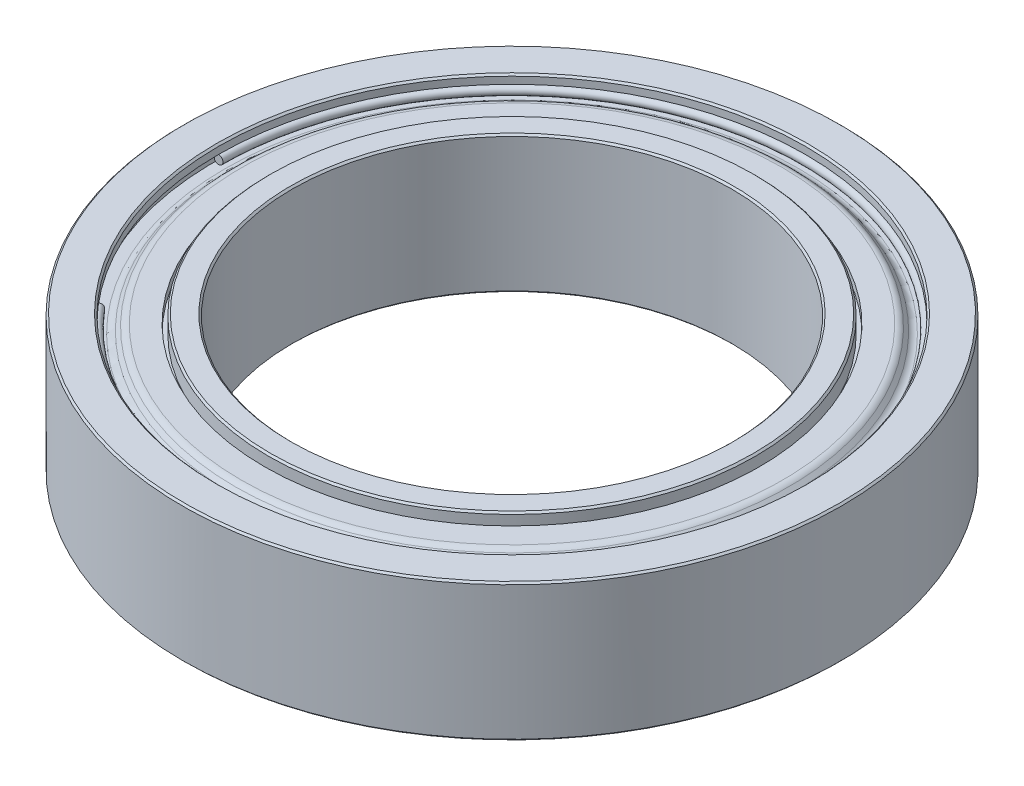
ISO-10303-21;
HEADER;
FILE_DESCRIPTION(('STEP AP214'),'2;1');
FILE_NAME('part.step','',(''),(''),'','','');
FILE_SCHEMA(('AUTOMOTIVE_DESIGN { 1 0 10303 214 1 1 1 1 }'));
ENDSEC;
DATA;
#1=APPLICATION_CONTEXT('core data for automotive mechanical design processes');
#2=APPLICATION_PROTOCOL_DEFINITION('international standard','automotive_design',2000,#1);
#3=PRODUCT_CONTEXT('',#1,'mechanical');
#4=PRODUCT('Part','Part','',(#3));
#5=PRODUCT_RELATED_PRODUCT_CATEGORY('part','',(#4));
#6=PRODUCT_DEFINITION_FORMATION('','',#4);
#7=PRODUCT_DEFINITION_CONTEXT('part definition',#1,'design');
#8=PRODUCT_DEFINITION('design','',#6,#7);
#9=PRODUCT_DEFINITION_SHAPE('','',#8);
#10=(LENGTH_UNIT() NAMED_UNIT(*) SI_UNIT(.MILLI.,.METRE.));
#11=(NAMED_UNIT(*) PLANE_ANGLE_UNIT() SI_UNIT($,.RADIAN.));
#12=(NAMED_UNIT(*) SI_UNIT($,.STERADIAN.) SOLID_ANGLE_UNIT());
#13=UNCERTAINTY_MEASURE_WITH_UNIT(LENGTH_MEASURE(1.E-05),#10,'distance_accuracy_value','');
#14=(GEOMETRIC_REPRESENTATION_CONTEXT(3) GLOBAL_UNCERTAINTY_ASSIGNED_CONTEXT((#13)) GLOBAL_UNIT_ASSIGNED_CONTEXT((#10,
#11,#12)) REPRESENTATION_CONTEXT('',''));
#15=CARTESIAN_POINT('',(0.,0.,0.));
#16=DIRECTION('',(0.,0.,1.));
#17=DIRECTION('',(1.,0.,0.));
#18=AXIS2_PLACEMENT_3D('',#15,#16,#17);
#19=CARTESIAN_POINT('',(0.,0.,0.));
#20=DIRECTION('',(0.64278760968653,0.,0.766044443118986));
#21=DIRECTION('',(0.766044443118986,0.,-0.64278760968653));
#22=AXIS2_PLACEMENT_3D('',#19,#20,#21);
#23=PLANE('',#22);
#24=CARTESIAN_POINT('',(-6.40152699336811,1.603375,5.37151893910646));
#25=CARTESIAN_POINT('',(-6.40153388771215,1.61760535707391,5.371524724148));
#26=CARTESIAN_POINT('',(-6.40339192267636,1.63192328029162,5.37308380060118));
#27=CARTESIAN_POINT('',(-6.41063050795078,1.65890213981076,5.37915769483519));
#28=CARTESIAN_POINT('',(-6.41601105826098,1.67156307611218,5.38367251261602));
#29=CARTESIAN_POINT('',(-6.42968009519439,1.6938588982527,5.39514219646539));
#30=CARTESIAN_POINT('',(-6.43796858181767,1.70349378409172,5.402097062534));
#31=CARTESIAN_POINT('',(-6.45652116513681,1.71863568307499,5.41766452835447));
#32=CARTESIAN_POINT('',(-6.46678526183267,1.72414269621925,5.42627712810634));
#33=CARTESIAN_POINT('',(-6.48813127804908,1.73041186264336,5.44418856244063));
#34=CARTESIAN_POINT('',(-6.49921319756962,1.73117401592321,5.45348739702306));
#35=CARTESIAN_POINT('',(-6.52094567214797,1.72786755040931,5.47172310842632));
#36=CARTESIAN_POINT('',(-6.53159622720577,1.72379893161555,5.48065998524715));
#37=CARTESIAN_POINT('',(-6.55126493147987,1.71128568190603,5.49716398774927));
#38=CARTESIAN_POINT('',(-6.56028308069616,1.70284105099026,5.50473111343057));
#39=CARTESIAN_POINT('',(-6.57567111865305,1.68254361413728,5.51764321040474));
#40=CARTESIAN_POINT('',(-6.58204100739366,1.67069080820007,5.52298818169762));
#41=CARTESIAN_POINT('',(-6.59141114673088,1.6448542051199,5.53085066215957));
#42=CARTESIAN_POINT('',(-6.59441139732751,1.63087040797693,5.53336817132864));
#43=CARTESIAN_POINT('',(-6.59592481258624,1.61228530553463,5.53463807751406));
#44=CARTESIAN_POINT('',(-6.59610444244233,1.60783445246292,5.53478880486005));
#45=CARTESIAN_POINT('',(-6.5960953875763,1.58914464292609,5.5347812069253));
#46=CARTESIAN_POINT('',(-6.59423735261209,1.57482671970838,5.53322213047212));
#47=CARTESIAN_POINT('',(-6.58699876733767,1.54784786018924,5.52714823623811));
#48=CARTESIAN_POINT('',(-6.58161821702747,1.53518692388782,5.52263341845729));
#49=CARTESIAN_POINT('',(-6.56794918009406,1.5128911017473,5.51116373460791));
#50=CARTESIAN_POINT('',(-6.55966069347078,1.50325621590828,5.50420886853931));
#51=CARTESIAN_POINT('',(-6.54110811015164,1.488114316925,5.48864140271883));
#52=CARTESIAN_POINT('',(-6.53084401345578,1.48260730378075,5.48002880296696));
#53=CARTESIAN_POINT('',(-6.50949799723937,1.47633813735664,5.46211736863267));
#54=CARTESIAN_POINT('',(-6.49841607771882,1.47557598407679,5.45281853405025));
#55=CARTESIAN_POINT('',(-6.47668360314048,1.47888244959069,5.43458282264699));
#56=CARTESIAN_POINT('',(-6.46603304808268,1.48295106838444,5.42564594582615));
#57=CARTESIAN_POINT('',(-6.44636434380859,1.49546431809397,5.40914194332403));
#58=CARTESIAN_POINT('',(-6.43734619459229,1.50390894900974,5.40157481764273));
#59=CARTESIAN_POINT('',(-6.4219581566354,1.52420638586272,5.38866272066856));
#60=CARTESIAN_POINT('',(-6.4155882678948,1.53605919179993,5.38331774937568));
#61=CARTESIAN_POINT('',(-6.40621812855757,1.5618957948801,5.37545526891373));
#62=CARTESIAN_POINT('',(-6.40321787796094,1.57587959202306,5.37293775974467));
#63=CARTESIAN_POINT('',(-6.40170446270221,1.59446469446536,5.37166785355925));
#64=CARTESIAN_POINT('',(-6.40152483284612,1.59891554753707,5.37151712621325));
#65=CARTESIAN_POINT('',(-6.40152699336811,1.603375,5.37151893910646));
#66=B_SPLINE_CURVE_WITH_KNOTS('',3,(#24,#25,#26,#27,#28,#29,#30,#31,#32,#33,#34,#35,#36,#37,#38,
#39,#40,#41,#42,#43,#44,#45,#46,#47,#48,#49,#50,#51,#52,#53,#54,#55,#56,#57,#58,#59,#60,#61,#62,
#63,#64,#65),.UNSPECIFIED.,.T.,.F.,(4,2,2,2,2,2,2,2,2,2,2,2,2,2,2,2,2,2,2,2,4),(0.,
0.0426429642402327,0.0852859284804661,0.127928892721774,0.170571856963084,0.213214821204392,
0.255857785445702,0.298500749687011,0.34114371392832,0.38378667816963,0.39714995998469,
0.439792924224922,0.482435888465155,0.525078852706464,0.567721816947774,0.610364781189083,
0.653007745430391,0.695650709671699,0.738293673913009,0.780936638154319,0.794299919969378),.UNSPECIFIED.);
#67=CARTESIAN_POINT('',(-6.40152699336811,1.603375,5.37151893910646));
#68=VERTEX_POINT('',#67);
#69=EDGE_CURVE('P0_E18',#68,#68,#66,.T.);
#70=ORIENTED_EDGE('',*,*,#69,.F.);
#71=EDGE_LOOP('',(#70));
#72=FACE_BOUND('',#71,.T.);
#73=ADVANCED_FACE('P0_F14',(#72),#23,.F.);
#74=CARTESIAN_POINT('',(0.,0.,0.));
#75=DIRECTION('',(0.,0.,1.));
#76=DIRECTION('',(1.,0.,0.));
#77=AXIS2_PLACEMENT_3D('',#74,#75,#76);
#78=PLANE('',#77);
#79=CARTESIAN_POINT('',(-8.6106,1.603375,0.));
#80=CARTESIAN_POINT('',(-8.61059100007304,1.61760535707391,0.));
#81=CARTESIAN_POINT('',(-8.60816550768693,1.63192328029162,0.));
#82=CARTESIAN_POINT('',(-8.59871620570525,1.65890213981076,0.));
#83=CARTESIAN_POINT('',(-8.59169239610969,1.67156307611218,0.));
#84=CARTESIAN_POINT('',(-8.57384873565866,1.6938588982527,0.));
#85=CARTESIAN_POINT('',(-8.56302888480311,1.70349378409172,0.));
#86=CARTESIAN_POINT('',(-8.53881020730236,1.71863568307499,0.));
#87=CARTESIAN_POINT('',(-8.52541138065716,1.72414269621925,0.));
#88=CARTESIAN_POINT('',(-8.49754613549006,1.73041186264336,0.));
#89=CARTESIAN_POINT('',(-8.48307971696815,1.73117401592321,0.));
#90=CARTESIAN_POINT('',(-8.45470998623835,1.72786755040931,0.));
#91=CARTESIAN_POINT('',(-8.44080667403046,1.72379893161555,0.));
#92=CARTESIAN_POINT('',(-8.41513100409934,1.71128568190603,0.));
#93=CARTESIAN_POINT('',(-8.4033586463761,1.70284105099026,0.));
#94=CARTESIAN_POINT('',(-8.38327098945865,1.68254361413728,0.));
#95=CARTESIAN_POINT('',(-8.37495569026443,1.67069080820007,0.));
#96=CARTESIAN_POINT('',(-8.36272384207156,1.6448542051199,0.));
#97=CARTESIAN_POINT('',(-8.3588072930729,1.63087040797693,0.));
#98=CARTESIAN_POINT('',(-8.35683166976236,1.61228530553463,0.));
#99=CARTESIAN_POINT('',(-8.35659717963884,1.60783445246292,0.));
#100=CARTESIAN_POINT('',(-8.35660899992696,1.58914464292609,0.));
#101=CARTESIAN_POINT('',(-8.35903449231307,1.57482671970838,0.));
#102=CARTESIAN_POINT('',(-8.36848379429475,1.54784786018924,0.));
#103=CARTESIAN_POINT('',(-8.37550760389031,1.53518692388782,0.));
#104=CARTESIAN_POINT('',(-8.39335126434134,1.5128911017473,0.));
#105=CARTESIAN_POINT('',(-8.4041711151969,1.50325621590828,0.));
#106=CARTESIAN_POINT('',(-8.42838979269765,1.488114316925,0.));
#107=CARTESIAN_POINT('',(-8.44178861934284,1.48260730378075,0.));
#108=CARTESIAN_POINT('',(-8.46965386450994,1.47633813735664,0.));
#109=CARTESIAN_POINT('',(-8.48412028303185,1.47557598407679,0.));
#110=CARTESIAN_POINT('',(-8.51249001376165,1.47888244959069,0.));
#111=CARTESIAN_POINT('',(-8.52639332596954,1.48295106838444,0.));
#112=CARTESIAN_POINT('',(-8.55206899590067,1.49546431809397,0.));
#113=CARTESIAN_POINT('',(-8.5638413536239,1.50390894900974,0.));
#114=CARTESIAN_POINT('',(-8.58392901054135,1.52420638586272,0.));
#115=CARTESIAN_POINT('',(-8.59224430973557,1.53605919179993,0.));
#116=CARTESIAN_POINT('',(-8.60447615792845,1.5618957948801,0.));
#117=CARTESIAN_POINT('',(-8.60839270692711,1.57587959202306,0.));
#118=CARTESIAN_POINT('',(-8.61036833023764,1.59446469446536,0.));
#119=CARTESIAN_POINT('',(-8.61060282036116,1.59891554753707,0.));
#120=CARTESIAN_POINT('',(-8.6106,1.603375,0.));
#121=B_SPLINE_CURVE_WITH_KNOTS('',3,(#79,#80,#81,#82,#83,#84,#85,#86,#87,#88,#89,#90,#91,#92,
#93,#94,#95,#96,#97,#98,#99,#100,#101,#102,#103,#104,#105,#106,#107,#108,#109,#110,#111,#112,
#113,#114,#115,#116,#117,#118,#119,#120),.UNSPECIFIED.,.T.,.F.,(4,2,2,2,2,2,2,2,2,2,2,2,2,2,2,2,
2,2,2,2,4),(0.,0.0426429642402329,0.085285928480466,0.127928892721774,0.170571856963085,
0.213214821204393,0.255857785445701,0.298500749687011,0.341143713928321,0.38378667816963,
0.397149959984689,0.439792924224922,0.482435888465155,0.525078852706464,0.567721816947774,
0.610364781189082,0.653007745430391,0.6956507096717,0.738293673913011,0.780936638154319,
0.794299919969379),.UNSPECIFIED.);
#122=CARTESIAN_POINT('',(-8.6106,1.603375,0.));
#123=VERTEX_POINT('',#122);
#124=EDGE_CURVE('P0_E10',#123,#123,#121,.T.);
#125=ORIENTED_EDGE('',*,*,#124,.F.);
#126=EDGE_LOOP('',(#125));
#127=FACE_BOUND('',#126,.T.);
#128=ADVANCED_FACE('P0_F34',(#127),#78,.T.);
#129=CARTESIAN_POINT('',(0.,1.603375,0.));
#130=DIRECTION('',(0.,1.,0.));
#131=DIRECTION('',(0.,0.,1.));
#132=AXIS2_PLACEMENT_3D('',#129,#130,#131);
#133=TOROIDAL_SURFACE('',#132,8.4836,0.127);
#134=ORIENTED_EDGE('',*,*,#124,.T.);
#135=EDGE_LOOP('',(#134));
#136=FACE_BOUND('',#135,.T.);
#137=ORIENTED_EDGE('',*,*,#69,.T.);
#138=EDGE_LOOP('',(#137));
#139=FACE_BOUND('',#138,.T.);
#140=ADVANCED_FACE('P0_F32',(#136,#139),#133,.T.);
#141=CLOSED_SHELL('',(#73,#128,#140));
#142=MANIFOLD_SOLID_BREP('P0_B1',#141);
#143=CARTESIAN_POINT('',(0.,0.,0.));
#144=DIRECTION('',(0.,0.,1.));
#145=DIRECTION('',(1.,0.,0.));
#146=AXIS2_PLACEMENT_3D('',#143,#144,#145);
#147=PLANE('',#146);
#148=CARTESIAN_POINT('',(-8.3566,-1.603375,0.));
#149=CARTESIAN_POINT('',(-8.35660899992696,-1.61760535707391,0.));
#150=CARTESIAN_POINT('',(-8.35903449231307,-1.63192328029162,0.));
#151=CARTESIAN_POINT('',(-8.36848379429475,-1.65890213981076,0.));
#152=CARTESIAN_POINT('',(-8.37550760389031,-1.67156307611218,0.));
#153=CARTESIAN_POINT('',(-8.39335126434134,-1.6938588982527,0.));
#154=CARTESIAN_POINT('',(-8.4041711151969,-1.70349378409172,0.));
#155=CARTESIAN_POINT('',(-8.42838979269765,-1.71863568307499,0.));
#156=CARTESIAN_POINT('',(-8.44178861934284,-1.72414269621925,0.));
#157=CARTESIAN_POINT('',(-8.46965386450994,-1.73041186264336,0.));
#158=CARTESIAN_POINT('',(-8.48412028303185,-1.73117401592321,0.));
#159=CARTESIAN_POINT('',(-8.51249001376165,-1.72786755040931,0.));
#160=CARTESIAN_POINT('',(-8.52639332596954,-1.72379893161555,0.));
#161=CARTESIAN_POINT('',(-8.55206899590067,-1.71128568190603,0.));
#162=CARTESIAN_POINT('',(-8.5638413536239,-1.70284105099026,0.));
#163=CARTESIAN_POINT('',(-8.58392901054135,-1.68254361413728,0.));
#164=CARTESIAN_POINT('',(-8.59224430973557,-1.67069080820007,0.));
#165=CARTESIAN_POINT('',(-8.60447615792845,-1.6448542051199,0.));
#166=CARTESIAN_POINT('',(-8.60839270692711,-1.63087040797693,0.));
#167=CARTESIAN_POINT('',(-8.61036833023764,-1.61228530553463,0.));
#168=CARTESIAN_POINT('',(-8.61060282036116,-1.60783445246292,0.));
#169=CARTESIAN_POINT('',(-8.61059100007304,-1.58914464292609,0.));
#170=CARTESIAN_POINT('',(-8.60816550768693,-1.57482671970838,0.));
#171=CARTESIAN_POINT('',(-8.59871620570525,-1.54784786018924,0.));
#172=CARTESIAN_POINT('',(-8.59169239610969,-1.53518692388782,0.));
#173=CARTESIAN_POINT('',(-8.57384873565866,-1.5128911017473,0.));
#174=CARTESIAN_POINT('',(-8.56302888480311,-1.50325621590828,0.));
#175=CARTESIAN_POINT('',(-8.53881020730236,-1.488114316925,0.));
#176=CARTESIAN_POINT('',(-8.52541138065716,-1.48260730378075,0.));
#177=CARTESIAN_POINT('',(-8.49754613549006,-1.47633813735664,0.));
#178=CARTESIAN_POINT('',(-8.48307971696815,-1.47557598407679,0.));
#179=CARTESIAN_POINT('',(-8.45470998623835,-1.47888244959069,0.));
#180=CARTESIAN_POINT('',(-8.44080667403046,-1.48295106838444,0.));
#181=CARTESIAN_POINT('',(-8.41513100409934,-1.49546431809397,0.));
#182=CARTESIAN_POINT('',(-8.4033586463761,-1.50390894900974,0.));
#183=CARTESIAN_POINT('',(-8.38327098945865,-1.52420638586272,0.));
#184=CARTESIAN_POINT('',(-8.37495569026443,-1.53605919179993,0.));
#185=CARTESIAN_POINT('',(-8.36272384207156,-1.5618957948801,0.));
#186=CARTESIAN_POINT('',(-8.3588072930729,-1.57587959202306,0.));
#187=CARTESIAN_POINT('',(-8.35683166976236,-1.59446469446536,0.));
#188=CARTESIAN_POINT('',(-8.35659717963884,-1.59891554753707,0.));
#189=CARTESIAN_POINT('',(-8.3566,-1.603375,0.));
#190=B_SPLINE_CURVE_WITH_KNOTS('',3,(#148,#149,#150,#151,#152,#153,#154,#155,#156,#157,#158,
#159,#160,#161,#162,#163,#164,#165,#166,#167,#168,#169,#170,#171,#172,#173,#174,#175,#176,#177,
#178,#179,#180,#181,#182,#183,#184,#185,#186,#187,#188,#189),.UNSPECIFIED.,.T.,.F.,(4,2,2,2,2,2,
2,2,2,2,2,2,2,2,2,2,2,2,2,2,4),(0.,0.0426429642402327,0.0852859284804662,0.127928892721774,
0.170571856963085,0.213214821204393,0.255857785445701,0.298500749687011,0.341143713928322,
0.383786678169629,0.39714995998469,0.439792924224922,0.482435888465155,0.525078852706464,
0.567721816947774,0.610364781189082,0.653007745430391,0.6956507096717,0.73829367391301,
0.780936638154319,0.794299919969379),.UNSPECIFIED.);
#191=CARTESIAN_POINT('',(-8.3566,-1.603375,0.));
#192=VERTEX_POINT('',#191);
#193=EDGE_CURVE('P1_E18',#192,#192,#190,.T.);
#194=ORIENTED_EDGE('',*,*,#193,.F.);
#195=EDGE_LOOP('',(#194));
#196=FACE_BOUND('',#195,.T.);
#197=ADVANCED_FACE('P1_F14',(#196),#147,.T.);
#198=CARTESIAN_POINT('',(0.,0.,0.));
#199=DIRECTION('',(0.64278760968653,0.,0.766044443118986));
#200=DIRECTION('',(0.766044443118986,0.,-0.64278760968653));
#201=AXIS2_PLACEMENT_3D('',#198,#199,#200);
#202=PLANE('',#201);
#203=CARTESIAN_POINT('',(-6.59610228192034,-1.603375,5.53478699196684));
#204=CARTESIAN_POINT('',(-6.59609538757631,-1.61760535707391,5.5347812069253));
#205=CARTESIAN_POINT('',(-6.5942373526121,-1.63192328029162,5.53322213047211));
#206=CARTESIAN_POINT('',(-6.58699876733768,-1.65890213981076,5.52714823623811));
#207=CARTESIAN_POINT('',(-6.58161821702747,-1.67156307611218,5.52263341845729));
#208=CARTESIAN_POINT('',(-6.56794918009406,-1.6938588982527,5.51116373460791));
#209=CARTESIAN_POINT('',(-6.55966069347078,-1.70349378409172,5.5042088685393));
#210=CARTESIAN_POINT('',(-6.54110811015165,-1.71863568307499,5.48864140271883));
#211=CARTESIAN_POINT('',(-6.53084401345578,-1.72414269621925,5.48002880296696));
#212=CARTESIAN_POINT('',(-6.50949799723937,-1.73041186264336,5.46211736863267));
#213=CARTESIAN_POINT('',(-6.49841607771883,-1.73117401592321,5.45281853405024));
#214=CARTESIAN_POINT('',(-6.47668360314048,-1.72786755040931,5.43458282264698));
#215=CARTESIAN_POINT('',(-6.46603304808268,-1.72379893161555,5.42564594582615));
#216=CARTESIAN_POINT('',(-6.44636434380859,-1.71128568190603,5.40914194332402));
#217=CARTESIAN_POINT('',(-6.43734619459229,-1.70284105099026,5.40157481764273));
#218=CARTESIAN_POINT('',(-6.4219581566354,-1.68254361413728,5.38866272066856));
#219=CARTESIAN_POINT('',(-6.4155882678948,-1.67069080820007,5.38331774937568));
#220=CARTESIAN_POINT('',(-6.40621812855757,-1.6448542051199,5.37545526891373));
#221=CARTESIAN_POINT('',(-6.40321787796094,-1.63087040797693,5.37293775974466));
#222=CARTESIAN_POINT('',(-6.40170446270221,-1.61228530553463,5.37166785355924));
#223=CARTESIAN_POINT('',(-6.40152483284612,-1.60783445246292,5.37151712621325));
#224=CARTESIAN_POINT('',(-6.40153388771215,-1.58914464292609,5.37152472414799));
#225=CARTESIAN_POINT('',(-6.40339192267636,-1.57482671970838,5.37308380060118));
#226=CARTESIAN_POINT('',(-6.41063050795078,-1.54784786018924,5.37915769483519));
#227=CARTESIAN_POINT('',(-6.41601105826099,-1.53518692388782,5.38367251261601));
#228=CARTESIAN_POINT('',(-6.4296800951944,-1.5128911017473,5.39514219646539));
#229=CARTESIAN_POINT('',(-6.43796858181767,-1.50325621590828,5.40209706253399));
#230=CARTESIAN_POINT('',(-6.45652116513681,-1.488114316925,5.41766452835447));
#231=CARTESIAN_POINT('',(-6.46678526183267,-1.48260730378075,5.42627712810634));
#232=CARTESIAN_POINT('',(-6.48813127804908,-1.47633813735664,5.44418856244063));
#233=CARTESIAN_POINT('',(-6.49921319756963,-1.47557598407679,5.45348739702305));
#234=CARTESIAN_POINT('',(-6.52094567214798,-1.47888244959069,5.47172310842631));
#235=CARTESIAN_POINT('',(-6.53159622720578,-1.48295106838444,5.48065998524715));
#236=CARTESIAN_POINT('',(-6.55126493147987,-1.49546431809397,5.49716398774927));
#237=CARTESIAN_POINT('',(-6.56028308069616,-1.50390894900974,5.50473111343057));
#238=CARTESIAN_POINT('',(-6.57567111865306,-1.52420638586272,5.51764321040474));
#239=CARTESIAN_POINT('',(-6.58204100739366,-1.53605919179993,5.52298818169762));
#240=CARTESIAN_POINT('',(-6.59141114673089,-1.5618957948801,5.53085066215957));
#241=CARTESIAN_POINT('',(-6.59441139732751,-1.57587959202306,5.53336817132864));
#242=CARTESIAN_POINT('',(-6.59592481258624,-1.59446469446536,5.53463807751405));
#243=CARTESIAN_POINT('',(-6.59610444244234,-1.59891554753707,5.53478880486005));
#244=CARTESIAN_POINT('',(-6.59610228192034,-1.603375,5.53478699196684));
#245=B_SPLINE_CURVE_WITH_KNOTS('',3,(#203,#204,#205,#206,#207,#208,#209,#210,#211,#212,#213,
#214,#215,#216,#217,#218,#219,#220,#221,#222,#223,#224,#225,#226,#227,#228,#229,#230,#231,#232,
#233,#234,#235,#236,#237,#238,#239,#240,#241,#242,#243,#244),.UNSPECIFIED.,.T.,.F.,(4,2,2,2,2,2,
2,2,2,2,2,2,2,2,2,2,2,2,2,2,4),(0.,0.042642964240233,0.0852859284804657,0.127928892721774,
0.170571856963083,0.213214821204394,0.255857785445705,0.298500749687011,0.341143713928322,
0.38378667816963,0.397149959984689,0.439792924224922,0.482435888465155,0.525078852706463,
0.567721816947773,0.610364781189082,0.653007745430392,0.695650709671701,0.73829367391301,
0.780936638154319,0.794299919969378),.UNSPECIFIED.);
#246=CARTESIAN_POINT('',(-6.59610228192034,-1.603375,5.53478699196684));
#247=VERTEX_POINT('',#246);
#248=EDGE_CURVE('P1_E10',#247,#247,#245,.T.);
#249=ORIENTED_EDGE('',*,*,#248,.F.);
#250=EDGE_LOOP('',(#249));
#251=FACE_BOUND('',#250,.T.);
#252=ADVANCED_FACE('P1_F32',(#251),#202,.F.);
#253=CARTESIAN_POINT('',(0.,-1.603375,0.));
#254=DIRECTION('',(0.,-1.,0.));
#255=DIRECTION('',(0.,0.,1.));
#256=AXIS2_PLACEMENT_3D('',#253,#254,#255);
#257=TOROIDAL_SURFACE('',#256,8.4836,0.127);
#258=ORIENTED_EDGE('',*,*,#248,.T.);
#259=EDGE_LOOP('',(#258));
#260=FACE_BOUND('',#259,.T.);
#261=ORIENTED_EDGE('',*,*,#193,.T.);
#262=EDGE_LOOP('',(#261));
#263=FACE_BOUND('',#262,.T.);
#264=ADVANCED_FACE('P1_F34',(#260,#263),#257,.T.);
#265=CLOSED_SHELL('',(#197,#252,#264));
#266=MANIFOLD_SOLID_BREP('P1_B1',#265);
#267=CARTESIAN_POINT('',(0.,1.984375,0.));
#268=DIRECTION('',(0.,-1.,0.));
#269=DIRECTION('',(0.,0.,-1.));
#270=AXIS2_PLACEMENT_3D('',#267,#268,#269);
#271=CYLINDRICAL_SURFACE('',#270,6.35);
#272=CARTESIAN_POINT('',(0.,-1.93357500000957,0.));
#273=DIRECTION('',(0.,-1.,0.));
#274=DIRECTION('',(0.,0.,-1.));
#275=AXIS2_PLACEMENT_3D('',#272,#273,#274);
#276=CIRCLE('',#275,6.34999999999764);
#277=CARTESIAN_POINT('',(0.,-1.93357500000957,-6.34999999999764));
#278=VERTEX_POINT('',#277);
#279=EDGE_CURVE('P2_E408',#278,#278,#276,.T.);
#280=ORIENTED_EDGE('',*,*,#279,.T.);
#281=EDGE_LOOP('',(#280));
#282=FACE_BOUND('',#281,.T.);
#283=CARTESIAN_POINT('',(0.,1.93357500000957,0.));
#284=DIRECTION('',(0.,1.,0.));
#285=DIRECTION('',(0.,0.,1.));
#286=AXIS2_PLACEMENT_3D('',#283,#284,#285);
#287=CIRCLE('',#286,6.34999999999764);
#288=CARTESIAN_POINT('',(0.,1.93357500000957,6.34999999999764));
#289=VERTEX_POINT('',#288);
#290=EDGE_CURVE('P2_E411',#289,#289,#287,.T.);
#291=ORIENTED_EDGE('',*,*,#290,.T.);
#292=EDGE_LOOP('',(#291));
#293=FACE_BOUND('',#292,.T.);
#294=ADVANCED_FACE('P2_F15',(#282,#293),#271,.F.);
#295=CARTESIAN_POINT('',(0.,1.98437500000637,0.));
#296=DIRECTION('',(0.,1.,0.));
#297=DIRECTION('',(0.,0.,1.));
#298=AXIS2_PLACEMENT_3D('',#295,#296,#297);
#299=CONICAL_SURFACE('',#298,6.40079999999443,0.785398163397448);
#300=ORIENTED_EDGE('',*,*,#290,.F.);
#301=EDGE_LOOP('',(#300));
#302=FACE_BOUND('',#301,.T.);
#303=CARTESIAN_POINT('',(0.,1.98437500000637,0.));
#304=DIRECTION('',(0.,1.,0.));
#305=DIRECTION('',(0.,0.,1.));
#306=AXIS2_PLACEMENT_3D('',#303,#304,#305);
#307=CIRCLE('',#306,6.40079999999443);
#308=CARTESIAN_POINT('',(0.,1.98437500000637,6.40079999999443));
#309=VERTEX_POINT('',#308);
#310=EDGE_CURVE('P2_E406',#309,#309,#307,.F.);
#311=ORIENTED_EDGE('',*,*,#310,.F.);
#312=EDGE_LOOP('',(#311));
#313=FACE_BOUND('',#312,.T.);
#314=ADVANCED_FACE('P2_F184',(#302,#313),#299,.F.);
#315=CARTESIAN_POINT('',(0.,-1.98437499994952,0.));
#316=DIRECTION('',(0.,-1.,0.));
#317=DIRECTION('',(0.,0.,-1.));
#318=AXIS2_PLACEMENT_3D('',#315,#316,#317);
#319=CONICAL_SURFACE('',#318,6.40079999993759,0.785398163397448);
#320=CARTESIAN_POINT('',(0.,-1.98437499994952,0.));
#321=DIRECTION('',(0.,-1.,0.));
#322=DIRECTION('',(0.,0.,-1.));
#323=AXIS2_PLACEMENT_3D('',#320,#321,#322);
#324=CIRCLE('',#323,6.40079999993759);
#325=CARTESIAN_POINT('',(0.,-1.98437499994952,-6.40079999993759));
#326=VERTEX_POINT('',#325);
#327=EDGE_CURVE('P2_E404',#326,#326,#324,.T.);
#328=ORIENTED_EDGE('',*,*,#327,.T.);
#329=EDGE_LOOP('',(#328));
#330=FACE_BOUND('',#329,.T.);
#331=ORIENTED_EDGE('',*,*,#279,.F.);
#332=EDGE_LOOP('',(#331));
#333=FACE_BOUND('',#332,.T.);
#334=ADVANCED_FACE('P2_F181',(#330,#333),#319,.F.);
#335=CARTESIAN_POINT('',(0.,1.984375,0.));
#336=DIRECTION('',(0.,1.,0.));
#337=DIRECTION('',(0.,0.,1.));
#338=AXIS2_PLACEMENT_3D('',#335,#336,#337);
#339=PLANE('',#338);
#340=ORIENTED_EDGE('',*,*,#310,.T.);
#341=EDGE_LOOP('',(#340));
#342=FACE_BOUND('',#341,.T.);
#343=CARTESIAN_POINT('',(0.,1.98437500000637,0.));
#344=DIRECTION('',(0.,-1.,0.));
#345=DIRECTION('',(0.,0.,-1.));
#346=AXIS2_PLACEMENT_3D('',#343,#344,#345);
#347=CIRCLE('',#346,6.98499999998603);
#348=CARTESIAN_POINT('',(0.,1.98437500000637,-6.98499999998603));
#349=VERTEX_POINT('',#348);
#350=EDGE_CURVE('P2_E401',#349,#349,#347,.T.);
#351=ORIENTED_EDGE('',*,*,#350,.F.);
#352=EDGE_LOOP('',(#351));
#353=FACE_BOUND('',#352,.T.);
#354=ADVANCED_FACE('P2_F177',(#342,#353),#339,.T.);
#355=CARTESIAN_POINT('',(0.,-1.984375,0.));
#356=DIRECTION('',(0.,1.,0.));
#357=DIRECTION('',(0.,0.,1.));
#358=AXIS2_PLACEMENT_3D('',#355,#356,#357);
#359=PLANE('',#358);
#360=CARTESIAN_POINT('',(0.,-1.984375,0.));
#361=DIRECTION('',(0.,1.,0.));
#362=DIRECTION('',(0.,0.,1.));
#363=AXIS2_PLACEMENT_3D('',#360,#361,#362);
#364=CIRCLE('',#363,6.985);
#365=CARTESIAN_POINT('',(0.,-1.984375,6.985));
#366=VERTEX_POINT('',#365);
#367=EDGE_CURVE('P2_E397',#366,#366,#364,.T.);
#368=ORIENTED_EDGE('',*,*,#367,.F.);
#369=EDGE_LOOP('',(#368));
#370=FACE_BOUND('',#369,.T.);
#371=ORIENTED_EDGE('',*,*,#327,.F.);
#372=EDGE_LOOP('',(#371));
#373=FACE_BOUND('',#372,.T.);
#374=ADVANCED_FACE('P2_F173',(#370,#373),#359,.F.);
#375=CARTESIAN_POINT('',(0.,1.93357500006641,0.));
#376=DIRECTION('',(0.,-1.,0.));
#377=DIRECTION('',(0.,0.,-1.));
#378=AXIS2_PLACEMENT_3D('',#375,#376,#377);
#379=CONICAL_SURFACE('',#378,7.03579999992598,0.785398163397448);
#380=ORIENTED_EDGE('',*,*,#350,.T.);
#381=EDGE_LOOP('',(#380));
#382=FACE_BOUND('',#381,.T.);
#383=CARTESIAN_POINT('',(0.,1.93357500000001,0.));
#384=DIRECTION('',(0.,1.,0.));
#385=DIRECTION('',(0.,0.,1.));
#386=AXIS2_PLACEMENT_3D('',#383,#384,#385);
#387=CIRCLE('',#386,7.0358);
#388=CARTESIAN_POINT('',(0.,1.93357500000001,7.0358));
#389=VERTEX_POINT('',#388);
#390=EDGE_CURVE('P2_E400',#389,#389,#387,.F.);
#391=ORIENTED_EDGE('',*,*,#390,.F.);
#392=EDGE_LOOP('',(#391));
#393=FACE_BOUND('',#392,.T.);
#394=ADVANCED_FACE('P2_F169',(#382,#393),#379,.T.);
#395=CARTESIAN_POINT('',(0.,-1.933575,0.));
#396=DIRECTION('',(0.,1.,0.));
#397=DIRECTION('',(0.,0.,1.));
#398=AXIS2_PLACEMENT_3D('',#395,#396,#397);
#399=CONICAL_SURFACE('',#398,7.0358,0.785398163397446);
#400=CARTESIAN_POINT('',(0.,-1.933575,0.));
#401=DIRECTION('',(0.,-1.,0.));
#402=DIRECTION('',(0.,0.,-1.));
#403=AXIS2_PLACEMENT_3D('',#400,#401,#402);
#404=CIRCLE('',#403,7.0358);
#405=CARTESIAN_POINT('',(0.,-1.933575,-7.0358));
#406=VERTEX_POINT('',#405);
#407=EDGE_CURVE('P2_E77',#406,#406,#404,.F.);
#408=ORIENTED_EDGE('',*,*,#407,.F.);
#409=EDGE_LOOP('',(#408));
#410=FACE_BOUND('',#409,.T.);
#411=ORIENTED_EDGE('',*,*,#367,.T.);
#412=EDGE_LOOP('',(#411));
#413=FACE_BOUND('',#412,.T.);
#414=ADVANCED_FACE('P2_F165',(#410,#413),#399,.T.);
#415=CARTESIAN_POINT('',(0.,1.730375,0.));
#416=DIRECTION('',(0.,1.,0.));
#417=DIRECTION('',(0.,0.,1.));
#418=AXIS2_PLACEMENT_3D('',#415,#416,#417);
#419=CYLINDRICAL_SURFACE('',#418,7.0358);
#420=CARTESIAN_POINT('',(0.,1.476375,0.));
#421=DIRECTION('',(0.,1.,0.));
#422=DIRECTION('',(0.,0.,1.));
#423=AXIS2_PLACEMENT_3D('',#420,#421,#422);
#424=CIRCLE('',#423,7.0358);
#425=CARTESIAN_POINT('',(0.,1.476375,7.0358));
#426=VERTEX_POINT('',#425);
#427=EDGE_CURVE('P2_E394',#426,#426,#424,.F.);
#428=ORIENTED_EDGE('',*,*,#427,.F.);
#429=EDGE_LOOP('',(#428));
#430=FACE_BOUND('',#429,.T.);
#431=ORIENTED_EDGE('',*,*,#390,.T.);
#432=EDGE_LOOP('',(#431));
#433=FACE_BOUND('',#432,.T.);
#434=ADVANCED_FACE('P2_F161',(#430,#433),#419,.T.);
#435=CARTESIAN_POINT('',(0.,-1.730375,0.));
#436=DIRECTION('',(0.,-1.,0.));
#437=DIRECTION('',(0.,0.,-1.));
#438=AXIS2_PLACEMENT_3D('',#435,#436,#437);
#439=CYLINDRICAL_SURFACE('',#438,7.0358);
#440=ORIENTED_EDGE('',*,*,#407,.T.);
#441=EDGE_LOOP('',(#440));
#442=FACE_BOUND('',#441,.T.);
#443=CARTESIAN_POINT('',(0.,-1.476375,0.));
#444=DIRECTION('',(0.,-1.,0.));
#445=DIRECTION('',(0.,0.,-1.));
#446=AXIS2_PLACEMENT_3D('',#443,#444,#445);
#447=CIRCLE('',#446,7.0358);
#448=CARTESIAN_POINT('',(0.,-1.476375,-7.0358));
#449=VERTEX_POINT('',#448);
#450=EDGE_CURVE('P2_E391',#449,#449,#447,.F.);
#451=ORIENTED_EDGE('',*,*,#450,.F.);
#452=EDGE_LOOP('',(#451));
#453=FACE_BOUND('',#452,.T.);
#454=ADVANCED_FACE('P2_F157',(#442,#453),#439,.T.);
#455=CARTESIAN_POINT('',(0.,1.476375,0.));
#456=DIRECTION('',(0.,1.,0.));
#457=DIRECTION('',(0.,0.,1.));
#458=AXIS2_PLACEMENT_3D('',#455,#456,#457);
#459=PLANE('',#458);
#460=CARTESIAN_POINT('',(0.,1.476375,0.));
#461=DIRECTION('',(0.,1.,0.));
#462=DIRECTION('',(0.,0.,1.));
#463=AXIS2_PLACEMENT_3D('',#460,#461,#462);
#464=CIRCLE('',#463,7.15329558420875);
#465=CARTESIAN_POINT('',(0.,1.476375,7.15329558420875));
#466=VERTEX_POINT('',#465);
#467=EDGE_CURVE('P2_E388',#466,#466,#464,.T.);
#468=ORIENTED_EDGE('',*,*,#467,.T.);
#469=EDGE_LOOP('',(#468));
#470=FACE_BOUND('',#469,.T.);
#471=ORIENTED_EDGE('',*,*,#427,.T.);
#472=EDGE_LOOP('',(#471));
#473=FACE_BOUND('',#472,.T.);
#474=ADVANCED_FACE('P2_F153',(#470,#473),#459,.T.);
#475=CARTESIAN_POINT('',(0.,-1.476375,0.));
#476=DIRECTION('',(0.,-1.,0.));
#477=DIRECTION('',(0.,0.,-1.));
#478=AXIS2_PLACEMENT_3D('',#475,#476,#477);
#479=PLANE('',#478);
#480=ORIENTED_EDGE('',*,*,#450,.T.);
#481=EDGE_LOOP('',(#480));
#482=FACE_BOUND('',#481,.T.);
#483=CARTESIAN_POINT('',(0.,-1.476375,0.));
#484=DIRECTION('',(0.,-1.,0.));
#485=DIRECTION('',(0.,0.,-1.));
#486=AXIS2_PLACEMENT_3D('',#483,#484,#485);
#487=CIRCLE('',#486,7.15329558420875);
#488=CARTESIAN_POINT('',(0.,-1.476375,-7.15329558420875));
#489=VERTEX_POINT('',#488);
#490=EDGE_CURVE('P2_E385',#489,#489,#487,.T.);
#491=ORIENTED_EDGE('',*,*,#490,.T.);
#492=EDGE_LOOP('',(#491));
#493=FACE_BOUND('',#492,.T.);
#494=ADVANCED_FACE('P2_F149',(#482,#493),#479,.T.);
#495=CARTESIAN_POINT('',(0.,1.476375,0.));
#496=DIRECTION('',(0.,1.,0.));
#497=DIRECTION('',(0.,0.,1.));
#498=AXIS2_PLACEMENT_3D('',#495,#496,#497);
#499=CYLINDRICAL_SURFACE('',#498,7.15329558420875);
#500=CARTESIAN_POINT('',(0.,1.730375,0.));
#501=DIRECTION('',(0.,1.,0.));
#502=DIRECTION('',(0.,0.,1.));
#503=AXIS2_PLACEMENT_3D('',#500,#501,#502);
#504=CIRCLE('',#503,7.15329558420875);
#505=CARTESIAN_POINT('',(0.,1.730375,7.15329558420875));
#506=VERTEX_POINT('',#505);
#507=EDGE_CURVE('P2_E382',#506,#506,#504,.F.);
#508=ORIENTED_EDGE('',*,*,#507,.F.);
#509=EDGE_LOOP('',(#508));
#510=FACE_BOUND('',#509,.T.);
#511=ORIENTED_EDGE('',*,*,#467,.F.);
#512=EDGE_LOOP('',(#511));
#513=FACE_BOUND('',#512,.T.);
#514=ADVANCED_FACE('P2_F145',(#510,#513),#499,.F.);
#515=CARTESIAN_POINT('',(0.,-1.476375,0.));
#516=DIRECTION('',(0.,-1.,0.));
#517=DIRECTION('',(0.,0.,-1.));
#518=AXIS2_PLACEMENT_3D('',#515,#516,#517);
#519=CYLINDRICAL_SURFACE('',#518,7.15329558420875);
#520=ORIENTED_EDGE('',*,*,#490,.F.);
#521=EDGE_LOOP('',(#520));
#522=FACE_BOUND('',#521,.T.);
#523=CARTESIAN_POINT('',(0.,-1.730375,0.));
#524=DIRECTION('',(0.,-1.,0.));
#525=DIRECTION('',(0.,0.,-1.));
#526=AXIS2_PLACEMENT_3D('',#523,#524,#525);
#527=CIRCLE('',#526,7.15329558420875);
#528=CARTESIAN_POINT('',(0.,-1.730375,-7.15329558420875));
#529=VERTEX_POINT('',#528);
#530=EDGE_CURVE('P2_E63',#529,#529,#527,.F.);
#531=ORIENTED_EDGE('',*,*,#530,.F.);
#532=EDGE_LOOP('',(#531));
#533=FACE_BOUND('',#532,.T.);
#534=ADVANCED_FACE('P2_F141',(#522,#533),#519,.F.);
#535=CARTESIAN_POINT('',(0.,1.730375,0.));
#536=DIRECTION('',(0.,1.,0.));
#537=DIRECTION('',(0.,0.,1.));
#538=AXIS2_PLACEMENT_3D('',#535,#536,#537);
#539=PLANE('',#538);
#540=CARTESIAN_POINT('',(0.,1.730375,0.));
#541=DIRECTION('',(0.,-1.,0.));
#542=DIRECTION('',(0.,0.,-1.));
#543=AXIS2_PLACEMENT_3D('',#540,#541,#542);
#544=CIRCLE('',#543,7.82302198243957);
#545=CARTESIAN_POINT('',(0.,1.730375,-7.82302198243957));
#546=VERTEX_POINT('',#545);
#547=CARTESIAN_POINT('',(0.,1.730375,7.82302198243957));
#548=VERTEX_POINT('',#547);
#549=EDGE_CURVE('P2_E61',#546,#548,#544,.T.);
#550=ORIENTED_EDGE('',*,*,#549,.F.);
#551=CARTESIAN_POINT('',(0.,1.730375,0.));
#552=DIRECTION('',(0.,-1.,0.));
#553=DIRECTION('',(0.,0.,1.));
#554=AXIS2_PLACEMENT_3D('',#551,#552,#553);
#555=CIRCLE('',#554,7.82302198243957);
#556=EDGE_CURVE('P2_E55',#548,#546,#555,.T.);
#557=ORIENTED_EDGE('',*,*,#556,.F.);
#558=EDGE_LOOP('',(#550,#557));
#559=FACE_BOUND('',#558,.T.);
#560=ORIENTED_EDGE('',*,*,#507,.T.);
#561=EDGE_LOOP('',(#560));
#562=FACE_BOUND('',#561,.T.);
#563=ADVANCED_FACE('P2_F59',(#559,#562),#539,.T.);
#564=CARTESIAN_POINT('',(0.,-1.730375,0.));
#565=DIRECTION('',(0.,-1.,0.));
#566=DIRECTION('',(0.,0.,-1.));
#567=AXIS2_PLACEMENT_3D('',#564,#565,#566);
#568=PLANE('',#567);
#569=ORIENTED_EDGE('',*,*,#530,.T.);
#570=EDGE_LOOP('',(#569));
#571=FACE_BOUND('',#570,.T.);
#572=CARTESIAN_POINT('',(0.,-1.730375,0.));
#573=DIRECTION('',(0.,1.,0.));
#574=DIRECTION('',(0.,0.,1.));
#575=AXIS2_PLACEMENT_3D('',#572,#573,#574);
#576=CIRCLE('',#575,7.82302198243956);
#577=CARTESIAN_POINT('',(0.,-1.730375,7.82302198243956));
#578=VERTEX_POINT('',#577);
#579=CARTESIAN_POINT('',(0.,-1.730375,-7.82302198243956));
#580=VERTEX_POINT('',#579);
#581=EDGE_CURVE('P2_E104',#578,#580,#576,.T.);
#582=ORIENTED_EDGE('',*,*,#581,.F.);
#583=CARTESIAN_POINT('',(0.,-1.730375,0.));
#584=DIRECTION('',(0.,1.,0.));
#585=DIRECTION('',(0.,0.,-1.));
#586=AXIS2_PLACEMENT_3D('',#583,#584,#585);
#587=CIRCLE('',#586,7.82302198243956);
#588=EDGE_CURVE('P2_E69',#580,#578,#587,.T.);
#589=ORIENTED_EDGE('',*,*,#588,.F.);
#590=EDGE_LOOP('',(#582,#589));
#591=FACE_BOUND('',#590,.T.);
#592=ADVANCED_FACE('P2_F90',(#571,#591),#568,.T.);
#593=CARTESIAN_POINT('',(0.,1.476375,0.));
#594=DIRECTION('',(0.,1.,0.));
#595=DIRECTION('',(0.,0.,1.));
#596=AXIS2_PLACEMENT_3D('',#593,#594,#595);
#597=TOROIDAL_SURFACE('',#596,7.82302198243957,0.254);
#598=ORIENTED_EDGE('',*,*,#556,.T.);
#599=ORIENTED_EDGE('',*,*,#549,.T.);
#600=EDGE_LOOP('',(#598,#599));
#601=FACE_BOUND('',#600,.T.);
#602=CARTESIAN_POINT('',(0.,1.65598012242138,0.));
#603=DIRECTION('',(0.,-1.,0.));
#604=DIRECTION('',(0.,0.,-1.));
#605=AXIS2_PLACEMENT_3D('',#602,#603,#604);
#606=CIRCLE('',#605,8.00262710486095);
#607=CARTESIAN_POINT('',(0.,1.65598012242138,-8.00262710486095));
#608=VERTEX_POINT('',#607);
#609=EDGE_CURVE('P2_E99',#608,#608,#606,.T.);
#610=ORIENTED_EDGE('',*,*,#609,.F.);
#611=EDGE_LOOP('',(#610));
#612=FACE_BOUND('',#611,.T.);
#613=ADVANCED_FACE('P2_F67',(#601,#612),#597,.T.);
#614=CARTESIAN_POINT('',(0.,-1.476375,0.));
#615=DIRECTION('',(0.,-1.,0.));
#616=DIRECTION('',(0.,0.,-1.));
#617=AXIS2_PLACEMENT_3D('',#614,#615,#616);
#618=TOROIDAL_SURFACE('',#617,7.82302198243956,0.254);
#619=ORIENTED_EDGE('',*,*,#588,.T.);
#620=ORIENTED_EDGE('',*,*,#581,.T.);
#621=EDGE_LOOP('',(#619,#620));
#622=FACE_BOUND('',#621,.T.);
#623=CARTESIAN_POINT('',(0.,-1.65598012242138,0.));
#624=DIRECTION('',(0.,1.,0.));
#625=DIRECTION('',(0.,0.,1.));
#626=AXIS2_PLACEMENT_3D('',#623,#624,#625);
#627=CIRCLE('',#626,8.00262710486095);
#628=CARTESIAN_POINT('',(0.,-1.65598012242138,8.00262710486095));
#629=VERTEX_POINT('',#628);
#630=EDGE_CURVE('P2_E343',#629,#629,#627,.T.);
#631=ORIENTED_EDGE('',*,*,#630,.F.);
#632=EDGE_LOOP('',(#631));
#633=FACE_BOUND('',#632,.T.);
#634=ADVANCED_FACE('P2_F89',(#622,#633),#618,.T.);
#635=CARTESIAN_POINT('',(0.,1.55076987757862,0.));
#636=DIRECTION('',(0.,-1.,0.));
#637=DIRECTION('',(0.,0.,-1.));
#638=AXIS2_PLACEMENT_3D('',#635,#636,#637);
#639=CONICAL_SURFACE('',#638,8.10783734970371,0.785398163397444);
#640=CARTESIAN_POINT('',(0.,1.55076987757862,0.));
#641=DIRECTION('',(0.,1.,0.));
#642=DIRECTION('',(0.,0.,1.));
#643=AXIS2_PLACEMENT_3D('',#640,#641,#642);
#644=CIRCLE('',#643,8.10783734970371);
#645=CARTESIAN_POINT('',(0.,1.55076987757862,8.10783734970371));
#646=VERTEX_POINT('',#645);
#647=EDGE_CURVE('P2_E347',#646,#646,#644,.T.);
#648=ORIENTED_EDGE('',*,*,#647,.T.);
#649=EDGE_LOOP('',(#648));
#650=FACE_BOUND('',#649,.T.);
#651=ORIENTED_EDGE('',*,*,#609,.T.);
#652=EDGE_LOOP('',(#651));
#653=FACE_BOUND('',#652,.T.);
#654=ADVANCED_FACE('P2_F503',(#650,#653),#639,.T.);
#655=CARTESIAN_POINT('',(0.,-1.55076987757861,0.));
#656=DIRECTION('',(0.,1.,0.));
#657=DIRECTION('',(0.,0.,1.));
#658=AXIS2_PLACEMENT_3D('',#655,#656,#657);
#659=CONICAL_SURFACE('',#658,8.10783734970372,0.785398163397453);
#660=CARTESIAN_POINT('',(0.,-1.55076987757861,0.));
#661=DIRECTION('',(0.,-1.,0.));
#662=DIRECTION('',(0.,0.,-1.));
#663=AXIS2_PLACEMENT_3D('',#660,#661,#662);
#664=CIRCLE('',#663,8.10783734970371);
#665=CARTESIAN_POINT('',(0.,-1.55076987757861,-8.10783734970371));
#666=VERTEX_POINT('',#665);
#667=EDGE_CURVE('P2_E352',#666,#666,#664,.T.);
#668=ORIENTED_EDGE('',*,*,#667,.T.);
#669=EDGE_LOOP('',(#668));
#670=FACE_BOUND('',#669,.T.);
#671=ORIENTED_EDGE('',*,*,#630,.T.);
#672=EDGE_LOOP('',(#671));
#673=FACE_BOUND('',#672,.T.);
#674=ADVANCED_FACE('P2_F509',(#670,#673),#659,.T.);
#675=CARTESIAN_POINT('',(0.,1.730375,0.));
#676=DIRECTION('',(0.,1.,0.));
#677=DIRECTION('',(0.,0.,1.));
#678=AXIS2_PLACEMENT_3D('',#675,#676,#677);
#679=TOROIDAL_SURFACE('',#678,8.2874424721251,0.254);
#680=ORIENTED_EDGE('',*,*,#647,.F.);
#681=EDGE_LOOP('',(#680));
#682=FACE_BOUND('',#681,.T.);
#683=CARTESIAN_POINT('',(0.,1.476375,0.));
#684=DIRECTION('',(0.,1.,0.));
#685=DIRECTION('',(0.,0.,-1.));
#686=AXIS2_PLACEMENT_3D('',#683,#684,#685);
#687=CIRCLE('',#686,8.2874424721251);
#688=CARTESIAN_POINT('',(0.,1.476375,8.2874424721251));
#689=VERTEX_POINT('',#688);
#690=CARTESIAN_POINT('',(0.,1.476375,-8.2874424721251));
#691=VERTEX_POINT('',#690);
#692=EDGE_CURVE('P2_E279',#689,#691,#687,.F.);
#693=ORIENTED_EDGE('',*,*,#692,.F.);
#694=CARTESIAN_POINT('',(0.,1.476375,0.));
#695=DIRECTION('',(0.,1.,0.));
#696=DIRECTION('',(0.,0.,1.));
#697=AXIS2_PLACEMENT_3D('',#694,#695,#696);
#698=CIRCLE('',#697,8.2874424721251);
#699=EDGE_CURVE('P2_E289',#691,#689,#698,.F.);
#700=ORIENTED_EDGE('',*,*,#699,.F.);
#701=EDGE_LOOP('',(#693,#700));
#702=FACE_BOUND('',#701,.T.);
#703=ADVANCED_FACE('P2_F304',(#682,#702),#679,.F.);
#704=CARTESIAN_POINT('',(0.,-1.730375,0.));
#705=DIRECTION('',(0.,-1.,0.));
#706=DIRECTION('',(0.,0.,-1.));
#707=AXIS2_PLACEMENT_3D('',#704,#705,#706);
#708=TOROIDAL_SURFACE('',#707,8.28744247212509,0.254);
#709=ORIENTED_EDGE('',*,*,#667,.F.);
#710=EDGE_LOOP('',(#709));
#711=FACE_BOUND('',#710,.T.);
#712=CARTESIAN_POINT('',(0.,-1.476375,0.));
#713=DIRECTION('',(0.,-1.,0.));
#714=DIRECTION('',(0.,0.,1.));
#715=AXIS2_PLACEMENT_3D('',#712,#713,#714);
#716=CIRCLE('',#715,8.28744247212509);
#717=CARTESIAN_POINT('',(0.,-1.476375,-8.28744247212509));
#718=VERTEX_POINT('',#717);
#719=CARTESIAN_POINT('',(0.,-1.476375,8.28744247212509));
#720=VERTEX_POINT('',#719);
#721=EDGE_CURVE('P2_E367',#718,#720,#716,.F.);
#722=ORIENTED_EDGE('',*,*,#721,.F.);
#723=CARTESIAN_POINT('',(0.,-1.476375,0.));
#724=DIRECTION('',(0.,-1.,0.));
#725=DIRECTION('',(0.,0.,-1.));
#726=AXIS2_PLACEMENT_3D('',#723,#724,#725);
#727=CIRCLE('',#726,8.28744247212509);
#728=EDGE_CURVE('P2_E34',#720,#718,#727,.F.);
#729=ORIENTED_EDGE('',*,*,#728,.F.);
#730=EDGE_LOOP('',(#722,#729));
#731=FACE_BOUND('',#730,.T.);
#732=ADVANCED_FACE('P2_F300',(#711,#731),#708,.F.);
#733=CARTESIAN_POINT('',(0.,1.476375,0.));
#734=DIRECTION('',(0.,1.,0.));
#735=DIRECTION('',(0.,0.,1.));
#736=AXIS2_PLACEMENT_3D('',#733,#734,#735);
#737=PLANE('',#736);
#738=ORIENTED_EDGE('',*,*,#692,.T.);
#739=ORIENTED_EDGE('',*,*,#699,.T.);
#740=EDGE_LOOP('',(#738,#739));
#741=FACE_BOUND('',#740,.T.);
#742=CARTESIAN_POINT('',(0.,1.476375,0.));
#743=DIRECTION('',(0.,1.,0.));
#744=DIRECTION('',(0.,0.,1.));
#745=AXIS2_PLACEMENT_3D('',#742,#743,#744);
#746=CIRCLE('',#745,8.6106);
#747=CARTESIAN_POINT('',(0.,1.476375,8.6106));
#748=VERTEX_POINT('',#747);
#749=EDGE_CURVE('P2_E369',#748,#748,#746,.T.);
#750=ORIENTED_EDGE('',*,*,#749,.T.);
#751=EDGE_LOOP('',(#750));
#752=FACE_BOUND('',#751,.T.);
#753=ADVANCED_FACE('P2_F256',(#741,#752),#737,.T.);
#754=CARTESIAN_POINT('',(0.,-1.476375,0.));
#755=DIRECTION('',(0.,-1.,0.));
#756=DIRECTION('',(0.,0.,-1.));
#757=AXIS2_PLACEMENT_3D('',#754,#755,#756);
#758=PLANE('',#757);
#759=CARTESIAN_POINT('',(0.,-1.476375,0.));
#760=DIRECTION('',(0.,-1.,0.));
#761=DIRECTION('',(0.,0.,-1.));
#762=AXIS2_PLACEMENT_3D('',#759,#760,#761);
#763=CIRCLE('',#762,8.6106);
#764=CARTESIAN_POINT('',(0.,-1.476375,-8.6106));
#765=VERTEX_POINT('',#764);
#766=EDGE_CURVE('P2_E371',#765,#765,#763,.T.);
#767=ORIENTED_EDGE('',*,*,#766,.T.);
#768=EDGE_LOOP('',(#767));
#769=FACE_BOUND('',#768,.T.);
#770=ORIENTED_EDGE('',*,*,#721,.T.);
#771=ORIENTED_EDGE('',*,*,#728,.T.);
#772=EDGE_LOOP('',(#770,#771));
#773=FACE_BOUND('',#772,.T.);
#774=ADVANCED_FACE('P2_F251',(#769,#773),#758,.T.);
#775=CARTESIAN_POINT('',(0.,1.476375,0.));
#776=DIRECTION('',(0.,1.,0.));
#777=DIRECTION('',(0.,0.,1.));
#778=AXIS2_PLACEMENT_3D('',#775,#776,#777);
#779=CYLINDRICAL_SURFACE('',#778,8.6106);
#780=ORIENTED_EDGE('',*,*,#749,.F.);
#781=EDGE_LOOP('',(#780));
#782=FACE_BOUND('',#781,.T.);
#783=CARTESIAN_POINT('',(0.,1.730375,0.));
#784=DIRECTION('',(0.,1.,0.));
#785=DIRECTION('',(0.,0.,1.));
#786=AXIS2_PLACEMENT_3D('',#783,#784,#785);
#787=CIRCLE('',#786,8.6106);
#788=CARTESIAN_POINT('',(0.,1.730375,8.6106));
#789=VERTEX_POINT('',#788);
#790=EDGE_CURVE('P2_E376',#789,#789,#787,.T.);
#791=ORIENTED_EDGE('',*,*,#790,.T.);
#792=EDGE_LOOP('',(#791));
#793=FACE_BOUND('',#792,.T.);
#794=ADVANCED_FACE('P2_F247',(#782,#793),#779,.F.);
#795=CARTESIAN_POINT('',(0.,-1.476375,0.));
#796=DIRECTION('',(0.,-1.,0.));
#797=DIRECTION('',(0.,0.,-1.));
#798=AXIS2_PLACEMENT_3D('',#795,#796,#797);
#799=CYLINDRICAL_SURFACE('',#798,8.6106);
#800=CARTESIAN_POINT('',(0.,-1.730375,0.));
#801=DIRECTION('',(0.,-1.,0.));
#802=DIRECTION('',(0.,0.,-1.));
#803=AXIS2_PLACEMENT_3D('',#800,#801,#802);
#804=CIRCLE('',#803,8.6106);
#805=CARTESIAN_POINT('',(0.,-1.730375,-8.6106));
#806=VERTEX_POINT('',#805);
#807=EDGE_CURVE('P2_E437',#806,#806,#804,.T.);
#808=ORIENTED_EDGE('',*,*,#807,.T.);
#809=EDGE_LOOP('',(#808));
#810=FACE_BOUND('',#809,.T.);
#811=ORIENTED_EDGE('',*,*,#766,.F.);
#812=EDGE_LOOP('',(#811));
#813=FACE_BOUND('',#812,.T.);
#814=ADVANCED_FACE('P2_F243',(#810,#813),#799,.F.);
#815=CARTESIAN_POINT('',(0.,1.730375,0.));
#816=DIRECTION('',(0.,1.,0.));
#817=DIRECTION('',(0.,0.,1.));
#818=AXIS2_PLACEMENT_3D('',#815,#816,#817);
#819=PLANE('',#818);
#820=CARTESIAN_POINT('',(0.,1.730375,0.));
#821=DIRECTION('',(0.,1.,0.));
#822=DIRECTION('',(0.,0.,1.));
#823=AXIS2_PLACEMENT_3D('',#820,#821,#822);
#824=CIRCLE('',#823,8.4836);
#825=CARTESIAN_POINT('',(0.,1.730375,8.4836));
#826=VERTEX_POINT('',#825);
#827=EDGE_CURVE('P2_E434',#826,#826,#824,.T.);
#828=ORIENTED_EDGE('',*,*,#827,.T.);
#829=EDGE_LOOP('',(#828));
#830=FACE_BOUND('',#829,.T.);
#831=ORIENTED_EDGE('',*,*,#790,.F.);
#832=EDGE_LOOP('',(#831));
#833=FACE_BOUND('',#832,.T.);
#834=ADVANCED_FACE('P2_F239',(#830,#833),#819,.F.);
#835=CARTESIAN_POINT('',(0.,-1.730375,0.));
#836=DIRECTION('',(0.,-1.,0.));
#837=DIRECTION('',(0.,0.,-1.));
#838=AXIS2_PLACEMENT_3D('',#835,#836,#837);
#839=PLANE('',#838);
#840=ORIENTED_EDGE('',*,*,#807,.F.);
#841=EDGE_LOOP('',(#840));
#842=FACE_BOUND('',#841,.T.);
#843=CARTESIAN_POINT('',(0.,-1.730375,0.));
#844=DIRECTION('',(0.,-1.,0.));
#845=DIRECTION('',(0.,0.,-1.));
#846=AXIS2_PLACEMENT_3D('',#843,#844,#845);
#847=CIRCLE('',#846,8.4836);
#848=CARTESIAN_POINT('',(0.,-1.730375,-8.4836));
#849=VERTEX_POINT('',#848);
#850=EDGE_CURVE('P2_E430',#849,#849,#847,.T.);
#851=ORIENTED_EDGE('',*,*,#850,.T.);
#852=EDGE_LOOP('',(#851));
#853=FACE_BOUND('',#852,.T.);
#854=ADVANCED_FACE('P2_F235',(#842,#853),#839,.F.);
#855=CARTESIAN_POINT('',(0.,1.730375,0.));
#856=DIRECTION('',(0.,1.,0.));
#857=DIRECTION('',(0.,0.,1.));
#858=AXIS2_PLACEMENT_3D('',#855,#856,#857);
#859=CYLINDRICAL_SURFACE('',#858,8.4836);
#860=ORIENTED_EDGE('',*,*,#827,.F.);
#861=EDGE_LOOP('',(#860));
#862=FACE_BOUND('',#861,.T.);
#863=CARTESIAN_POINT('',(0.,1.933575,0.));
#864=DIRECTION('',(0.,1.,0.));
#865=DIRECTION('',(0.,0.,1.));
#866=AXIS2_PLACEMENT_3D('',#863,#864,#865);
#867=CIRCLE('',#866,8.4836);
#868=CARTESIAN_POINT('',(0.,1.933575,8.4836));
#869=VERTEX_POINT('',#868);
#870=EDGE_CURVE('P2_E433',#869,#869,#867,.T.);
#871=ORIENTED_EDGE('',*,*,#870,.T.);
#872=EDGE_LOOP('',(#871));
#873=FACE_BOUND('',#872,.T.);
#874=ADVANCED_FACE('P2_F231',(#862,#873),#859,.F.);
#875=CARTESIAN_POINT('',(0.,-1.730375,0.));
#876=DIRECTION('',(0.,-1.,0.));
#877=DIRECTION('',(0.,0.,-1.));
#878=AXIS2_PLACEMENT_3D('',#875,#876,#877);
#879=CYLINDRICAL_SURFACE('',#878,8.4836);
#880=CARTESIAN_POINT('',(0.,-1.933575,0.));
#881=DIRECTION('',(0.,-1.,0.));
#882=DIRECTION('',(0.,0.,-1.));
#883=AXIS2_PLACEMENT_3D('',#880,#881,#882);
#884=CIRCLE('',#883,8.4836);
#885=CARTESIAN_POINT('',(0.,-1.933575,-8.4836));
#886=VERTEX_POINT('',#885);
#887=EDGE_CURVE('P2_E429',#886,#886,#884,.T.);
#888=ORIENTED_EDGE('',*,*,#887,.T.);
#889=EDGE_LOOP('',(#888));
#890=FACE_BOUND('',#889,.T.);
#891=ORIENTED_EDGE('',*,*,#850,.F.);
#892=EDGE_LOOP('',(#891));
#893=FACE_BOUND('',#892,.T.);
#894=ADVANCED_FACE('P2_F227',(#890,#893),#879,.F.);
#895=CARTESIAN_POINT('',(0.,1.984375,0.));
#896=DIRECTION('',(0.,1.,0.));
#897=DIRECTION('',(0.,0.,1.));
#898=AXIS2_PLACEMENT_3D('',#895,#896,#897);
#899=CONICAL_SURFACE('',#898,8.5344,0.785398163397418);
#900=ORIENTED_EDGE('',*,*,#870,.F.);
#901=EDGE_LOOP('',(#900));
#902=FACE_BOUND('',#901,.T.);
#903=CARTESIAN_POINT('',(0.,1.984375,0.));
#904=DIRECTION('',(0.,1.,0.));
#905=DIRECTION('',(0.,0.,1.));
#906=AXIS2_PLACEMENT_3D('',#903,#904,#905);
#907=CIRCLE('',#906,8.5344);
#908=CARTESIAN_POINT('',(0.,1.984375,8.5344));
#909=VERTEX_POINT('',#908);
#910=EDGE_CURVE('P2_E426',#909,#909,#907,.F.);
#911=ORIENTED_EDGE('',*,*,#910,.F.);
#912=EDGE_LOOP('',(#911));
#913=FACE_BOUND('',#912,.T.);
#914=ADVANCED_FACE('P2_F223',(#902,#913),#899,.F.);
#915=CARTESIAN_POINT('',(0.,-1.984375,0.));
#916=DIRECTION('',(0.,-1.,0.));
#917=DIRECTION('',(0.,0.,-1.));
#918=AXIS2_PLACEMENT_3D('',#915,#916,#917);
#919=CONICAL_SURFACE('',#918,8.5344,0.785398163397433);
#920=CARTESIAN_POINT('',(0.,-1.984375,0.));
#921=DIRECTION('',(0.,-1.,0.));
#922=DIRECTION('',(0.,0.,-1.));
#923=AXIS2_PLACEMENT_3D('',#920,#921,#922);
#924=CIRCLE('',#923,8.5344);
#925=CARTESIAN_POINT('',(0.,-1.984375,-8.5344));
#926=VERTEX_POINT('',#925);
#927=EDGE_CURVE('P2_E423',#926,#926,#924,.T.);
#928=ORIENTED_EDGE('',*,*,#927,.T.);
#929=EDGE_LOOP('',(#928));
#930=FACE_BOUND('',#929,.T.);
#931=ORIENTED_EDGE('',*,*,#887,.F.);
#932=EDGE_LOOP('',(#931));
#933=FACE_BOUND('',#932,.T.);
#934=ADVANCED_FACE('P2_F219',(#930,#933),#919,.F.);
#935=CARTESIAN_POINT('',(0.,1.984375,0.));
#936=DIRECTION('',(0.,1.,0.));
#937=DIRECTION('',(0.,0.,1.));
#938=AXIS2_PLACEMENT_3D('',#935,#936,#937);
#939=PLANE('',#938);
#940=ORIENTED_EDGE('',*,*,#910,.T.);
#941=EDGE_LOOP('',(#940));
#942=FACE_BOUND('',#941,.T.);
#943=CARTESIAN_POINT('',(0.,1.984375,0.));
#944=DIRECTION('',(0.,-1.,0.));
#945=DIRECTION('',(1.,0.,0.));
#946=AXIS2_PLACEMENT_3D('',#943,#944,#945);
#947=CIRCLE('',#946,9.4742);
#948=CARTESIAN_POINT('',(9.4742,1.984375,0.));
#949=VERTEX_POINT('',#948);
#950=EDGE_CURVE('P2_E420',#949,#949,#947,.T.);
#951=ORIENTED_EDGE('',*,*,#950,.F.);
#952=EDGE_LOOP('',(#951));
#953=FACE_BOUND('',#952,.T.);
#954=ADVANCED_FACE('P2_F215',(#942,#953),#939,.T.);
#955=CARTESIAN_POINT('',(0.,-1.984375,0.));
#956=DIRECTION('',(0.,1.,0.));
#957=DIRECTION('',(0.,0.,1.));
#958=AXIS2_PLACEMENT_3D('',#955,#956,#957);
#959=PLANE('',#958);
#960=CARTESIAN_POINT('',(0.,-1.984375,0.));
#961=DIRECTION('',(0.,1.,0.));
#962=DIRECTION('',(0.,0.,1.));
#963=AXIS2_PLACEMENT_3D('',#960,#961,#962);
#964=CIRCLE('',#963,9.4742);
#965=CARTESIAN_POINT('',(0.,-1.984375,9.4742));
#966=VERTEX_POINT('',#965);
#967=EDGE_CURVE('P2_E417',#966,#966,#964,.T.);
#968=ORIENTED_EDGE('',*,*,#967,.F.);
#969=EDGE_LOOP('',(#968));
#970=FACE_BOUND('',#969,.T.);
#971=ORIENTED_EDGE('',*,*,#927,.F.);
#972=EDGE_LOOP('',(#971));
#973=FACE_BOUND('',#972,.T.);
#974=ADVANCED_FACE('P2_F211',(#970,#973),#959,.F.);
#975=CARTESIAN_POINT('',(0.,1.933575,0.));
#976=DIRECTION('',(0.,-1.,0.));
#977=DIRECTION('',(1.,0.,0.));
#978=AXIS2_PLACEMENT_3D('',#975,#976,#977);
#979=CONICAL_SURFACE('',#978,9.525,0.785398163397446);
#980=ORIENTED_EDGE('',*,*,#950,.T.);
#981=EDGE_LOOP('',(#980));
#982=FACE_BOUND('',#981,.T.);
#983=CARTESIAN_POINT('',(0.,1.933575,0.));
#984=DIRECTION('',(0.,-1.,0.));
#985=DIRECTION('',(0.,0.,-1.));
#986=AXIS2_PLACEMENT_3D('',#983,#984,#985);
#987=CIRCLE('',#986,9.525);
#988=CARTESIAN_POINT('',(0.,1.933575,-9.525));
#989=VERTEX_POINT('',#988);
#990=EDGE_CURVE('P2_E26',#989,#989,#987,.T.);
#991=ORIENTED_EDGE('',*,*,#990,.F.);
#992=EDGE_LOOP('',(#991));
#993=FACE_BOUND('',#992,.T.);
#994=ADVANCED_FACE('P2_F203',(#982,#993),#979,.T.);
#995=CARTESIAN_POINT('',(0.,-1.933575,0.));
#996=DIRECTION('',(0.,1.,0.));
#997=DIRECTION('',(0.,0.,1.));
#998=AXIS2_PLACEMENT_3D('',#995,#996,#997);
#999=CONICAL_SURFACE('',#998,9.525,0.785398163397431);
#1000=CARTESIAN_POINT('',(0.,-1.933575,0.));
#1001=DIRECTION('',(0.,-1.,0.));
#1002=DIRECTION('',(0.,0.,-1.));
#1003=AXIS2_PLACEMENT_3D('',#1000,#1001,#1002);
#1004=CIRCLE('',#1003,9.525);
#1005=CARTESIAN_POINT('',(0.,-1.933575,-9.525));
#1006=VERTEX_POINT('',#1005);
#1007=EDGE_CURVE('P2_E10',#1006,#1006,#1004,.F.);
#1008=ORIENTED_EDGE('',*,*,#1007,.F.);
#1009=EDGE_LOOP('',(#1008));
#1010=FACE_BOUND('',#1009,.T.);
#1011=ORIENTED_EDGE('',*,*,#967,.T.);
#1012=EDGE_LOOP('',(#1011));
#1013=FACE_BOUND('',#1012,.T.);
#1014=ADVANCED_FACE('P2_F197',(#1010,#1013),#999,.T.);
#1015=CARTESIAN_POINT('',(0.,1.984375,0.));
#1016=DIRECTION('',(0.,-1.,0.));
#1017=DIRECTION('',(0.,0.,-1.));
#1018=AXIS2_PLACEMENT_3D('',#1015,#1016,#1017);
#1019=CYLINDRICAL_SURFACE('',#1018,9.525);
#1020=ORIENTED_EDGE('',*,*,#990,.T.);
#1021=EDGE_LOOP('',(#1020));
#1022=FACE_BOUND('',#1021,.T.);
#1023=ORIENTED_EDGE('',*,*,#1007,.T.);
#1024=EDGE_LOOP('',(#1023));
#1025=FACE_BOUND('',#1024,.T.);
#1026=ADVANCED_FACE('P2_F195',(#1022,#1025),#1019,.T.);
#1027=CLOSED_SHELL('',(#294,#314,#334,#354,#374,#394,#414,#434,#454,#474,#494,#514,#534,#563,
#592,#613,#634,#654,#674,#703,#732,#753,#774,#794,#814,#834,#854,#874,#894,#914,#934,#954,#974,
#994,#1014,#1026));
#1028=MANIFOLD_SOLID_BREP('P2_B1',#1027);
#1029=ADVANCED_BREP_SHAPE_REPRESENTATION('',(#18,#142,#266,#1028),#14);
#1030=SHAPE_DEFINITION_REPRESENTATION(#9,#1029);
ENDSEC;
END-ISO-10303-21;
